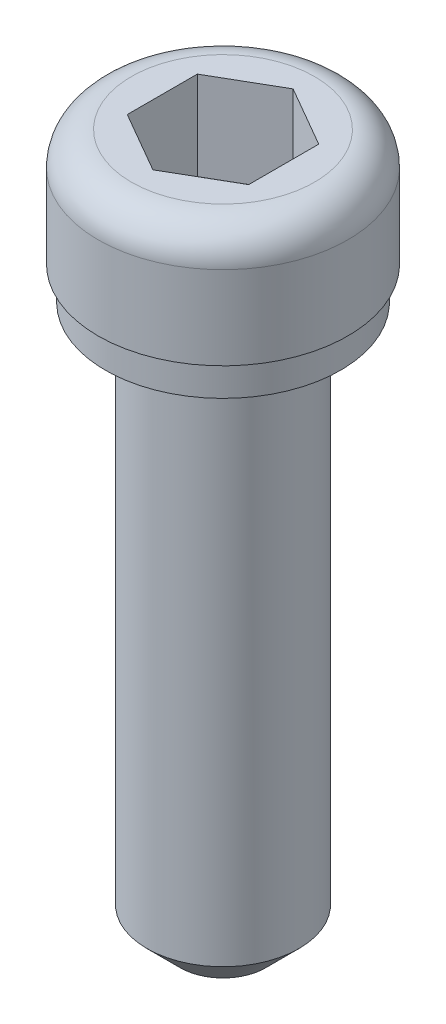
ISO-10303-21;
HEADER;
FILE_DESCRIPTION(('STEP AP214'),'2;1');
FILE_NAME('part.step','',(''),(''),'','','');
FILE_SCHEMA(('AUTOMOTIVE_DESIGN { 1 0 10303 214 1 1 1 1 }'));
ENDSEC;
DATA;
#1=APPLICATION_CONTEXT('core data for automotive mechanical design processes');
#2=APPLICATION_PROTOCOL_DEFINITION('international standard','automotive_design',2000,#1);
#3=PRODUCT_CONTEXT('',#1,'mechanical');
#4=PRODUCT('Part','Part','',(#3));
#5=PRODUCT_RELATED_PRODUCT_CATEGORY('part','',(#4));
#6=PRODUCT_DEFINITION_FORMATION('','',#4);
#7=PRODUCT_DEFINITION_CONTEXT('part definition',#1,'design');
#8=PRODUCT_DEFINITION('design','',#6,#7);
#9=PRODUCT_DEFINITION_SHAPE('','',#8);
#10=(LENGTH_UNIT() NAMED_UNIT(*) SI_UNIT(.MILLI.,.METRE.));
#11=(NAMED_UNIT(*) PLANE_ANGLE_UNIT() SI_UNIT($,.RADIAN.));
#12=(NAMED_UNIT(*) SI_UNIT($,.STERADIAN.) SOLID_ANGLE_UNIT());
#13=UNCERTAINTY_MEASURE_WITH_UNIT(LENGTH_MEASURE(1.E-05),#10,'distance_accuracy_value','');
#14=(GEOMETRIC_REPRESENTATION_CONTEXT(3) GLOBAL_UNCERTAINTY_ASSIGNED_CONTEXT((#13)) GLOBAL_UNIT_ASSIGNED_CONTEXT((#10,
#11,#12)) REPRESENTATION_CONTEXT('',''));
#15=CARTESIAN_POINT('',(0.,0.,0.));
#16=DIRECTION('',(0.,0.,1.));
#17=DIRECTION('',(1.,0.,0.));
#18=AXIS2_PLACEMENT_3D('',#15,#16,#17);
#19=CARTESIAN_POINT('',(-1.3890625,14.097,0.801975608296208));
#20=DIRECTION('',(-0.5,0.,0.866025403784439));
#21=DIRECTION('',(0.866025403784439,0.,0.5));
#22=AXIS2_PLACEMENT_3D('',#19,#20,#21);
#23=PLANE('',#22);
#24=DIRECTION('',(0.866025403784439,0.,0.5));
#25=VECTOR('',#24,1.);
#26=CARTESIAN_POINT('',(-1.3890625,14.097,0.801975608296208));
#27=LINE('',#26,#25);
#28=CARTESIAN_POINT('',(-1.38906249999999,14.097,0.801975608296209));
#29=VERTEX_POINT('',#28);
#30=CARTESIAN_POINT('',(0.,14.097,1.60395121659243));
#31=VERTEX_POINT('',#30);
#32=EDGE_CURVE('E69',#29,#31,#27,.T.);
#33=ORIENTED_EDGE('',*,*,#32,.F.);
#34=DIRECTION('',(0.,1.,0.));
#35=VECTOR('',#34,1.);
#36=CARTESIAN_POINT('',(-1.38906249999999,14.097,0.801975608296209));
#37=LINE('',#36,#35);
#38=CARTESIAN_POINT('',(-1.38906249999999,16.129,0.80197560829621));
#39=VERTEX_POINT('',#38);
#40=EDGE_CURVE('E92',#29,#39,#37,.T.);
#41=ORIENTED_EDGE('',*,*,#40,.T.);
#42=DIRECTION('',(0.866025403784439,0.,0.5));
#43=VECTOR('',#42,1.);
#44=CARTESIAN_POINT('',(-1.3890625,16.129,0.801975608296208));
#45=LINE('',#44,#43);
#46=CARTESIAN_POINT('',(0.,16.129,1.60395121659243));
#47=VERTEX_POINT('',#46);
#48=EDGE_CURVE('E78',#47,#39,#45,.F.);
#49=ORIENTED_EDGE('',*,*,#48,.F.);
#50=DIRECTION('',(0.,1.,0.));
#51=VECTOR('',#50,1.);
#52=CARTESIAN_POINT('',(0.,14.097,1.60395121659243));
#53=LINE('',#52,#51);
#54=EDGE_CURVE('E87',#47,#31,#53,.F.);
#55=ORIENTED_EDGE('',*,*,#54,.T.);
#56=EDGE_LOOP('',(#33,#41,#49,#55));
#57=FACE_BOUND('',#56,.T.);
#58=ADVANCED_FACE('F15',(#57),#23,.F.);
#59=CARTESIAN_POINT('',(0.,14.097,1.60395121659243));
#60=DIRECTION('',(0.5,0.,0.866025403784439));
#61=DIRECTION('',(0.866025403784439,0.,-0.5));
#62=AXIS2_PLACEMENT_3D('',#59,#60,#61);
#63=PLANE('',#62);
#64=DIRECTION('',(0.866025403784439,0.,-0.5));
#65=VECTOR('',#64,1.);
#66=CARTESIAN_POINT('',(0.,14.097,1.60395121659243));
#67=LINE('',#66,#65);
#68=CARTESIAN_POINT('',(1.3890625,14.097,0.801975608296223));
#69=VERTEX_POINT('',#68);
#70=EDGE_CURVE('E96',#31,#69,#67,.T.);
#71=ORIENTED_EDGE('',*,*,#70,.F.);
#72=ORIENTED_EDGE('',*,*,#54,.F.);
#73=DIRECTION('',(0.866025403784439,0.,-0.5));
#74=VECTOR('',#73,1.);
#75=CARTESIAN_POINT('',(0.,16.129,1.60395121659243));
#76=LINE('',#75,#74);
#77=CARTESIAN_POINT('',(1.3890625,16.129,0.801975608296223));
#78=VERTEX_POINT('',#77);
#79=EDGE_CURVE('E74',#78,#47,#76,.F.);
#80=ORIENTED_EDGE('',*,*,#79,.F.);
#81=DIRECTION('',(0.,1.,0.));
#82=VECTOR('',#81,1.);
#83=CARTESIAN_POINT('',(1.3890625,14.097,0.801975608296219));
#84=LINE('',#83,#82);
#85=EDGE_CURVE('E183',#78,#69,#84,.F.);
#86=ORIENTED_EDGE('',*,*,#85,.T.);
#87=EDGE_LOOP('',(#71,#72,#80,#86));
#88=FACE_BOUND('',#87,.T.);
#89=ADVANCED_FACE('F95',(#88),#63,.F.);
#90=CARTESIAN_POINT('',(-1.38906249999999,14.097,-0.801975608296236));
#91=DIRECTION('',(-1.,0.,0.));
#92=DIRECTION('',(0.,0.,1.));
#93=AXIS2_PLACEMENT_3D('',#90,#91,#92);
#94=PLANE('',#93);
#95=DIRECTION('',(0.,0.,1.));
#96=VECTOR('',#95,1.);
#97=CARTESIAN_POINT('',(-1.38906249999999,14.097,0.));
#98=LINE('',#97,#96);
#99=CARTESIAN_POINT('',(-1.38906249999999,14.097,-0.801975608296228));
#100=VERTEX_POINT('',#99);
#101=EDGE_CURVE('E181',#100,#29,#98,.T.);
#102=ORIENTED_EDGE('',*,*,#101,.F.);
#103=DIRECTION('',(0.,1.,0.));
#104=VECTOR('',#103,1.);
#105=CARTESIAN_POINT('',(-1.38906249999999,14.097,-0.801975608296227));
#106=LINE('',#105,#104);
#107=CARTESIAN_POINT('',(-1.38906249999999,16.129,-0.801975608296228));
#108=VERTEX_POINT('',#107);
#109=EDGE_CURVE('E169',#100,#108,#106,.T.);
#110=ORIENTED_EDGE('',*,*,#109,.T.);
#111=DIRECTION('',(0.,0.,1.));
#112=VECTOR('',#111,1.);
#113=CARTESIAN_POINT('',(-1.38906249999999,16.129,-0.801975608296236));
#114=LINE('',#113,#112);
#115=EDGE_CURVE('E98',#39,#108,#114,.F.);
#116=ORIENTED_EDGE('',*,*,#115,.F.);
#117=ORIENTED_EDGE('',*,*,#40,.F.);
#118=EDGE_LOOP('',(#102,#110,#116,#117));
#119=FACE_BOUND('',#118,.T.);
#120=ADVANCED_FACE('F189',(#119),#94,.F.);
#121=CARTESIAN_POINT('',(1.3890625,14.097,0.801975608296219));
#122=DIRECTION('',(1.,0.,0.));
#123=DIRECTION('',(0.,0.,-1.));
#124=AXIS2_PLACEMENT_3D('',#121,#122,#123);
#125=PLANE('',#124);
#126=DIRECTION('',(0.,0.,1.));
#127=VECTOR('',#126,1.);
#128=CARTESIAN_POINT('',(1.3890625,14.097,0.));
#129=LINE('',#128,#127);
#130=CARTESIAN_POINT('',(1.3890625,14.097,-0.801975608296219));
#131=VERTEX_POINT('',#130);
#132=EDGE_CURVE('E178',#69,#131,#129,.F.);
#133=ORIENTED_EDGE('',*,*,#132,.F.);
#134=ORIENTED_EDGE('',*,*,#85,.F.);
#135=DIRECTION('',(0.,0.,-1.));
#136=VECTOR('',#135,1.);
#137=CARTESIAN_POINT('',(1.3890625,16.129,0.801975608296219));
#138=LINE('',#137,#136);
#139=CARTESIAN_POINT('',(1.3890625,16.129,-0.801975608296219));
#140=VERTEX_POINT('',#139);
#141=EDGE_CURVE('E82',#140,#78,#138,.F.);
#142=ORIENTED_EDGE('',*,*,#141,.F.);
#143=DIRECTION('',(0.,1.,0.));
#144=VECTOR('',#143,1.);
#145=CARTESIAN_POINT('',(1.3890625,14.097,-0.801975608296219));
#146=LINE('',#145,#144);
#147=EDGE_CURVE('E167',#140,#131,#146,.F.);
#148=ORIENTED_EDGE('',*,*,#147,.T.);
#149=EDGE_LOOP('',(#133,#134,#142,#148));
#150=FACE_BOUND('',#149,.T.);
#151=ADVANCED_FACE('F200',(#150),#125,.F.);
#152=CARTESIAN_POINT('',(0.,14.097,0.));
#153=DIRECTION('',(0.,1.,0.));
#154=DIRECTION('',(0.,0.,1.));
#155=AXIS2_PLACEMENT_3D('',#152,#153,#154);
#156=PLANE('',#155);
#157=ORIENTED_EDGE('',*,*,#132,.T.);
#158=DIRECTION('',(-0.866025403784439,0.,-0.5));
#159=VECTOR('',#158,1.);
#160=CARTESIAN_POINT('',(1.3890625,14.097,-0.801975608296219));
#161=LINE('',#160,#159);
#162=CARTESIAN_POINT('',(0.,14.097,-1.60395121659244));
#163=VERTEX_POINT('',#162);
#164=EDGE_CURVE('E165',#131,#163,#161,.T.);
#165=ORIENTED_EDGE('',*,*,#164,.T.);
#166=DIRECTION('',(-0.866025403784439,0.,0.5));
#167=VECTOR('',#166,1.);
#168=CARTESIAN_POINT('',(0.,14.097,-1.60395121659244));
#169=LINE('',#168,#167);
#170=EDGE_CURVE('E172',#163,#100,#169,.T.);
#171=ORIENTED_EDGE('',*,*,#170,.T.);
#172=ORIENTED_EDGE('',*,*,#101,.T.);
#173=ORIENTED_EDGE('',*,*,#32,.T.);
#174=ORIENTED_EDGE('',*,*,#70,.T.);
#175=EDGE_LOOP('',(#157,#165,#171,#172,#173,#174));
#176=FACE_BOUND('',#175,.T.);
#177=ADVANCED_FACE('F201',(#176),#156,.T.);
#178=CARTESIAN_POINT('',(0.,14.097,-1.60395121659244));
#179=DIRECTION('',(-0.5,0.,-0.866025403784439));
#180=DIRECTION('',(-0.866025403784439,0.,0.5));
#181=AXIS2_PLACEMENT_3D('',#178,#179,#180);
#182=PLANE('',#181);
#183=ORIENTED_EDGE('',*,*,#170,.F.);
#184=DIRECTION('',(0.,1.,0.));
#185=VECTOR('',#184,1.);
#186=CARTESIAN_POINT('',(0.,14.097,-1.60395121659243));
#187=LINE('',#186,#185);
#188=CARTESIAN_POINT('',(0.,16.129,-1.60395121659244));
#189=VERTEX_POINT('',#188);
#190=EDGE_CURVE('E162',#163,#189,#187,.T.);
#191=ORIENTED_EDGE('',*,*,#190,.T.);
#192=DIRECTION('',(-0.866025403784439,0.,0.5));
#193=VECTOR('',#192,1.);
#194=CARTESIAN_POINT('',(0.,16.129,-1.60395121659244));
#195=LINE('',#194,#193);
#196=EDGE_CURVE('E175',#108,#189,#195,.F.);
#197=ORIENTED_EDGE('',*,*,#196,.F.);
#198=ORIENTED_EDGE('',*,*,#109,.F.);
#199=EDGE_LOOP('',(#183,#191,#197,#198));
#200=FACE_BOUND('',#199,.T.);
#201=ADVANCED_FACE('F192',(#200),#182,.F.);
#202=CARTESIAN_POINT('',(1.3890625,14.097,-0.801975608296219));
#203=DIRECTION('',(0.5,0.,-0.866025403784439));
#204=DIRECTION('',(-0.866025403784439,0.,-0.5));
#205=AXIS2_PLACEMENT_3D('',#202,#203,#204);
#206=PLANE('',#205);
#207=ORIENTED_EDGE('',*,*,#164,.F.);
#208=ORIENTED_EDGE('',*,*,#147,.F.);
#209=DIRECTION('',(-0.866025403784439,0.,-0.5));
#210=VECTOR('',#209,1.);
#211=CARTESIAN_POINT('',(1.3890625,16.129,-0.801975608296221));
#212=LINE('',#211,#210);
#213=EDGE_CURVE('E154',#140,#189,#212,.T.);
#214=ORIENTED_EDGE('',*,*,#213,.T.);
#215=ORIENTED_EDGE('',*,*,#190,.F.);
#216=EDGE_LOOP('',(#207,#208,#214,#215));
#217=FACE_BOUND('',#216,.T.);
#218=ADVANCED_FACE('F197',(#217),#206,.F.);
#219=CARTESIAN_POINT('',(-2.0955,16.129,0.));
#220=DIRECTION('',(0.,-1.,0.));
#221=DIRECTION('',(0.,0.,-1.));
#222=AXIS2_PLACEMENT_3D('',#219,#220,#221);
#223=PLANE('',#222);
#224=ORIENTED_EDGE('',*,*,#141,.T.);
#225=ORIENTED_EDGE('',*,*,#79,.T.);
#226=ORIENTED_EDGE('',*,*,#48,.T.);
#227=ORIENTED_EDGE('',*,*,#115,.T.);
#228=ORIENTED_EDGE('',*,*,#196,.T.);
#229=ORIENTED_EDGE('',*,*,#213,.F.);
#230=EDGE_LOOP('',(#224,#225,#226,#227,#228,#229));
#231=FACE_BOUND('',#230,.T.);
#232=CARTESIAN_POINT('',(0.,16.129,0.));
#233=DIRECTION('',(0.,-1.,0.));
#234=DIRECTION('',(0.,0.,1.));
#235=AXIS2_PLACEMENT_3D('',#232,#233,#234);
#236=CIRCLE('',#235,2.0955);
#237=CARTESIAN_POINT('',(0.,16.129,2.0955));
#238=VERTEX_POINT('',#237);
#239=CARTESIAN_POINT('',(0.,16.129,-2.0955));
#240=VERTEX_POINT('',#239);
#241=EDGE_CURVE('E119',#238,#240,#236,.T.);
#242=ORIENTED_EDGE('',*,*,#241,.F.);
#243=CARTESIAN_POINT('',(0.,16.129,0.));
#244=DIRECTION('',(0.,-1.,0.));
#245=DIRECTION('',(0.,0.,-1.));
#246=AXIS2_PLACEMENT_3D('',#243,#244,#245);
#247=CIRCLE('',#246,2.0955);
#248=EDGE_CURVE('E34',#240,#238,#247,.T.);
#249=ORIENTED_EDGE('',*,*,#248,.F.);
#250=EDGE_LOOP('',(#242,#249));
#251=FACE_BOUND('',#250,.T.);
#252=ADVANCED_FACE('F76',(#231,#251),#223,.F.);
#253=CARTESIAN_POINT('',(0.,15.367,0.));
#254=DIRECTION('',(0.,-1.,0.));
#255=DIRECTION('',(0.,0.,-1.));
#256=AXIS2_PLACEMENT_3D('',#253,#254,#255);
#257=TOROIDAL_SURFACE('',#256,2.0955,0.762);
#258=ORIENTED_EDGE('',*,*,#248,.T.);
#259=ORIENTED_EDGE('',*,*,#241,.T.);
#260=EDGE_LOOP('',(#258,#259));
#261=FACE_BOUND('',#260,.T.);
#262=CARTESIAN_POINT('',(0.,15.367,0.));
#263=DIRECTION('',(0.,-1.,0.));
#264=DIRECTION('',(0.,0.,-1.));
#265=AXIS2_PLACEMENT_3D('',#262,#263,#264);
#266=CIRCLE('',#265,2.8575);
#267=CARTESIAN_POINT('',(0.,15.367,-2.8575));
#268=VERTEX_POINT('',#267);
#269=EDGE_CURVE('E117',#268,#268,#266,.T.);
#270=ORIENTED_EDGE('',*,*,#269,.F.);
#271=EDGE_LOOP('',(#270));
#272=FACE_BOUND('',#271,.T.);
#273=ADVANCED_FACE('F122',(#261,#272),#257,.T.);
#274=CARTESIAN_POINT('',(0.,0.,0.));
#275=DIRECTION('',(0.,-1.,0.));
#276=DIRECTION('',(0.,0.,-1.));
#277=AXIS2_PLACEMENT_3D('',#274,#275,#276);
#278=CYLINDRICAL_SURFACE('',#277,2.8575);
#279=ORIENTED_EDGE('',*,*,#269,.T.);
#280=EDGE_LOOP('',(#279));
#281=FACE_BOUND('',#280,.T.);
#282=CARTESIAN_POINT('',(0.,13.462,0.));
#283=DIRECTION('',(0.,-1.,0.));
#284=DIRECTION('',(0.,0.,-1.));
#285=AXIS2_PLACEMENT_3D('',#282,#283,#284);
#286=CIRCLE('',#285,2.8575);
#287=CARTESIAN_POINT('',(0.,13.462,-2.8575));
#288=VERTEX_POINT('',#287);
#289=EDGE_CURVE('E114',#288,#288,#286,.F.);
#290=ORIENTED_EDGE('',*,*,#289,.T.);
#291=EDGE_LOOP('',(#290));
#292=FACE_BOUND('',#291,.T.);
#293=ADVANCED_FACE('F133',(#281,#292),#278,.T.);
#294=CARTESIAN_POINT('',(-2.8575,13.462,0.));
#295=DIRECTION('',(0.,1.,0.));
#296=DIRECTION('',(0.,0.,1.));
#297=AXIS2_PLACEMENT_3D('',#294,#295,#296);
#298=PLANE('',#297);
#299=CARTESIAN_POINT('',(0.,13.462,0.));
#300=DIRECTION('',(0.,-1.,0.));
#301=DIRECTION('',(0.,0.,-1.));
#302=AXIS2_PLACEMENT_3D('',#299,#300,#301);
#303=CIRCLE('',#302,2.6924);
#304=CARTESIAN_POINT('',(0.,13.462,-2.6924));
#305=VERTEX_POINT('',#304);
#306=EDGE_CURVE('E111',#305,#305,#303,.T.);
#307=ORIENTED_EDGE('',*,*,#306,.F.);
#308=EDGE_LOOP('',(#307));
#309=FACE_BOUND('',#308,.T.);
#310=ORIENTED_EDGE('',*,*,#289,.F.);
#311=EDGE_LOOP('',(#310));
#312=FACE_BOUND('',#311,.T.);
#313=ADVANCED_FACE('F233',(#309,#312),#298,.F.);
#314=CARTESIAN_POINT('',(0.,0.,0.));
#315=DIRECTION('',(0.,-1.,0.));
#316=DIRECTION('',(0.,0.,-1.));
#317=AXIS2_PLACEMENT_3D('',#314,#315,#316);
#318=CYLINDRICAL_SURFACE('',#317,2.6924);
#319=ORIENTED_EDGE('',*,*,#306,.T.);
#320=EDGE_LOOP('',(#319));
#321=FACE_BOUND('',#320,.T.);
#322=CARTESIAN_POINT('',(0.,12.7,0.));
#323=DIRECTION('',(0.,-1.,0.));
#324=DIRECTION('',(0.,0.,-1.));
#325=AXIS2_PLACEMENT_3D('',#322,#323,#324);
#326=CIRCLE('',#325,2.6924);
#327=CARTESIAN_POINT('',(0.,12.7,-2.6924));
#328=VERTEX_POINT('',#327);
#329=EDGE_CURVE('E108',#328,#328,#326,.F.);
#330=ORIENTED_EDGE('',*,*,#329,.T.);
#331=EDGE_LOOP('',(#330));
#332=FACE_BOUND('',#331,.T.);
#333=ADVANCED_FACE('F230',(#321,#332),#318,.T.);
#334=CARTESIAN_POINT('',(0.,0.,0.));
#335=DIRECTION('',(0.,1.,0.));
#336=DIRECTION('',(0.,0.,1.));
#337=AXIS2_PLACEMENT_3D('',#334,#335,#336);
#338=PLANE('',#337);
#339=CARTESIAN_POINT('',(0.,-5.6843418860808E-11,0.));
#340=DIRECTION('',(0.,1.,0.));
#341=DIRECTION('',(0.,0.,1.));
#342=AXIS2_PLACEMENT_3D('',#339,#340,#341);
#343=CIRCLE('',#342,0.977899999952569);
#344=CARTESIAN_POINT('',(0.,-5.6843418860808E-11,0.977899999952569));
#345=VERTEX_POINT('',#344);
#346=EDGE_CURVE('E105',#345,#345,#343,.T.);
#347=ORIENTED_EDGE('',*,*,#346,.F.);
#348=EDGE_LOOP('',(#347));
#349=FACE_BOUND('',#348,.T.);
#350=ADVANCED_FACE('F226',(#349),#338,.F.);
#351=CARTESIAN_POINT('',(-1.7399,12.7,0.));
#352=DIRECTION('',(0.,1.,0.));
#353=DIRECTION('',(0.,0.,1.));
#354=AXIS2_PLACEMENT_3D('',#351,#352,#353);
#355=PLANE('',#354);
#356=CARTESIAN_POINT('',(0.,12.7,0.));
#357=DIRECTION('',(0.,-1.,0.));
#358=DIRECTION('',(0.,0.,-1.));
#359=AXIS2_PLACEMENT_3D('',#356,#357,#358);
#360=CIRCLE('',#359,1.7399);
#361=CARTESIAN_POINT('',(0.,12.7,-1.7399));
#362=VERTEX_POINT('',#361);
#363=EDGE_CURVE('E26',#362,#362,#360,.T.);
#364=ORIENTED_EDGE('',*,*,#363,.F.);
#365=EDGE_LOOP('',(#364));
#366=FACE_BOUND('',#365,.T.);
#367=ORIENTED_EDGE('',*,*,#329,.F.);
#368=EDGE_LOOP('',(#367));
#369=FACE_BOUND('',#368,.T.);
#370=ADVANCED_FACE('F219',(#366,#369),#355,.F.);
#371=CARTESIAN_POINT('',(0.,0.762000000008811,0.));
#372=DIRECTION('',(0.,1.,0.));
#373=DIRECTION('',(0.,0.,1.));
#374=AXIS2_PLACEMENT_3D('',#371,#372,#373);
#375=CONICAL_SURFACE('',#374,1.73990000001822,0.785398163397448);
#376=CARTESIAN_POINT('',(0.,0.761999999999999,0.));
#377=DIRECTION('',(0.,-1.,0.));
#378=DIRECTION('',(0.,0.,-1.));
#379=AXIS2_PLACEMENT_3D('',#376,#377,#378);
#380=CIRCLE('',#379,1.7399);
#381=CARTESIAN_POINT('',(0.,0.761999999999999,-1.7399));
#382=VERTEX_POINT('',#381);
#383=EDGE_CURVE('E10',#382,#382,#380,.F.);
#384=ORIENTED_EDGE('',*,*,#383,.F.);
#385=EDGE_LOOP('',(#384));
#386=FACE_BOUND('',#385,.T.);
#387=ORIENTED_EDGE('',*,*,#346,.T.);
#388=EDGE_LOOP('',(#387));
#389=FACE_BOUND('',#388,.T.);
#390=ADVANCED_FACE('F213',(#386,#389),#375,.T.);
#391=CARTESIAN_POINT('',(0.,0.,0.));
#392=DIRECTION('',(0.,-1.,0.));
#393=DIRECTION('',(0.,0.,-1.));
#394=AXIS2_PLACEMENT_3D('',#391,#392,#393);
#395=CYLINDRICAL_SURFACE('',#394,1.7399);
#396=ORIENTED_EDGE('',*,*,#363,.T.);
#397=EDGE_LOOP('',(#396));
#398=FACE_BOUND('',#397,.T.);
#399=ORIENTED_EDGE('',*,*,#383,.T.);
#400=EDGE_LOOP('',(#399));
#401=FACE_BOUND('',#400,.T.);
#402=ADVANCED_FACE('F211',(#398,#401),#395,.T.);
#403=CLOSED_SHELL('',(#58,#89,#120,#151,#177,#201,#218,#252,#273,#293,#313,#333,#350,#370,#390,#402));
#404=MANIFOLD_SOLID_BREP('B1',#403);
#405=ADVANCED_BREP_SHAPE_REPRESENTATION('',(#18,#404),#14);
#406=SHAPE_DEFINITION_REPRESENTATION(#9,#405);
ENDSEC;
END-ISO-10303-21;
